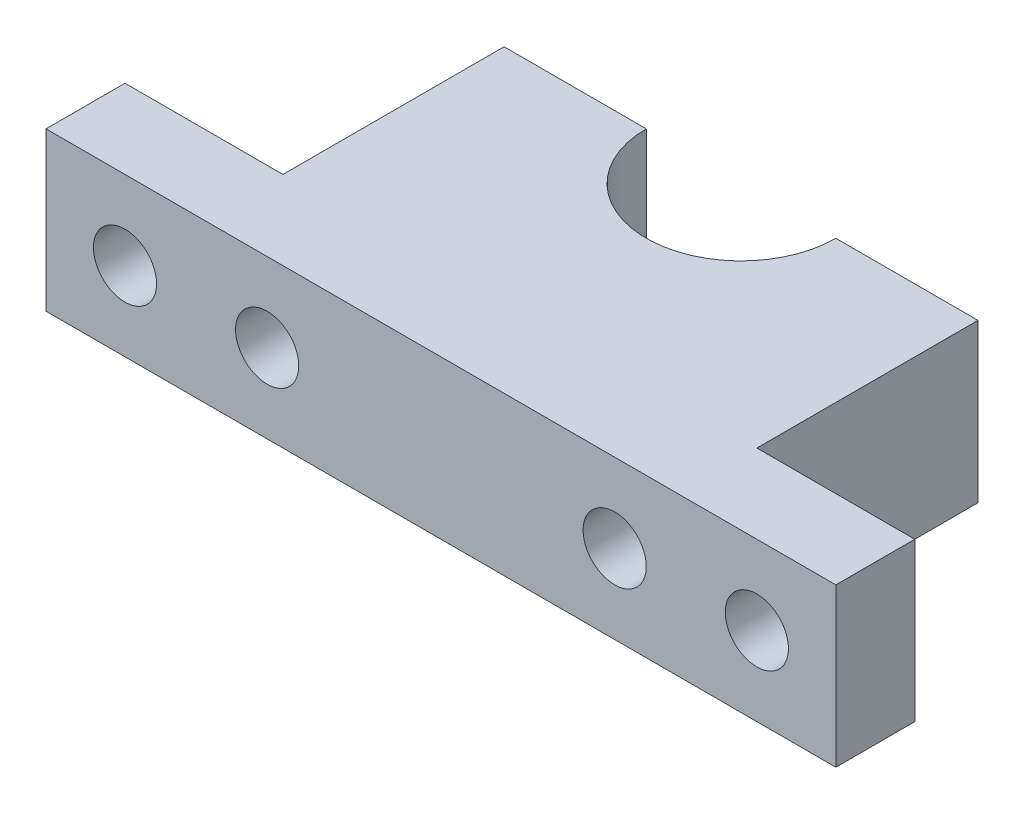
ISO-10303-21;
HEADER;
FILE_DESCRIPTION(('STEP AP214'),'2;1');
FILE_NAME('part.step','',(''),(''),'','','');
FILE_SCHEMA(('AUTOMOTIVE_DESIGN { 1 0 10303 214 1 1 1 1 }'));
ENDSEC;
DATA;
#1=APPLICATION_CONTEXT('core data for automotive mechanical design processes');
#2=APPLICATION_PROTOCOL_DEFINITION('international standard','automotive_design',2000,#1);
#3=PRODUCT_CONTEXT('',#1,'mechanical');
#4=PRODUCT('Part','Part','',(#3));
#5=PRODUCT_RELATED_PRODUCT_CATEGORY('part','',(#4));
#6=PRODUCT_DEFINITION_FORMATION('','',#4);
#7=PRODUCT_DEFINITION_CONTEXT('part definition',#1,'design');
#8=PRODUCT_DEFINITION('design','',#6,#7);
#9=PRODUCT_DEFINITION_SHAPE('','',#8);
#10=(LENGTH_UNIT() NAMED_UNIT(*) SI_UNIT(.MILLI.,.METRE.));
#11=(NAMED_UNIT(*) PLANE_ANGLE_UNIT() SI_UNIT($,.RADIAN.));
#12=(NAMED_UNIT(*) SI_UNIT($,.STERADIAN.) SOLID_ANGLE_UNIT());
#13=UNCERTAINTY_MEASURE_WITH_UNIT(LENGTH_MEASURE(1.E-05),#10,'distance_accuracy_value','');
#14=(GEOMETRIC_REPRESENTATION_CONTEXT(3) GLOBAL_UNCERTAINTY_ASSIGNED_CONTEXT((#13)) GLOBAL_UNIT_ASSIGNED_CONTEXT((#10,
#11,#12)) REPRESENTATION_CONTEXT('',''));
#15=CARTESIAN_POINT('',(0.,0.,0.));
#16=DIRECTION('',(0.,0.,1.));
#17=DIRECTION('',(1.,0.,0.));
#18=AXIS2_PLACEMENT_3D('',#15,#16,#17);
#19=CARTESIAN_POINT('',(-25.,10.,0.));
#20=DIRECTION('',(1.,0.,0.));
#21=DIRECTION('',(0.,0.,-1.));
#22=AXIS2_PLACEMENT_3D('',#19,#20,#21);
#23=PLANE('',#22);
#24=DIRECTION('',(0.,0.,1.));
#25=VECTOR('',#24,1.);
#26=CARTESIAN_POINT('',(-25.,0.,0.));
#27=LINE('',#26,#25);
#28=CARTESIAN_POINT('',(-25.,0.,-5.));
#29=VERTEX_POINT('',#28);
#30=CARTESIAN_POINT('',(-25.,0.,0.));
#31=VERTEX_POINT('',#30);
#32=EDGE_CURVE('E156',#29,#31,#27,.T.);
#33=ORIENTED_EDGE('',*,*,#32,.T.);
#34=DIRECTION('',(0.,-1.,0.));
#35=VECTOR('',#34,1.);
#36=CARTESIAN_POINT('',(-25.,10.,0.));
#37=LINE('',#36,#35);
#38=CARTESIAN_POINT('',(-25.,10.,0.));
#39=VERTEX_POINT('',#38);
#40=EDGE_CURVE('E11',#39,#31,#37,.T.);
#41=ORIENTED_EDGE('',*,*,#40,.F.);
#42=DIRECTION('',(0.,0.,1.));
#43=VECTOR('',#42,1.);
#44=CARTESIAN_POINT('',(-25.,10.,0.));
#45=LINE('',#44,#43);
#46=CARTESIAN_POINT('',(-25.,10.,-5.));
#47=VERTEX_POINT('',#46);
#48=EDGE_CURVE('E184',#47,#39,#45,.T.);
#49=ORIENTED_EDGE('',*,*,#48,.F.);
#50=DIRECTION('',(0.,-1.,0.));
#51=VECTOR('',#50,1.);
#52=CARTESIAN_POINT('',(-25.,10.,-5.));
#53=LINE('',#52,#51);
#54=EDGE_CURVE('E152',#47,#29,#53,.T.);
#55=ORIENTED_EDGE('',*,*,#54,.T.);
#56=EDGE_LOOP('',(#33,#41,#49,#55));
#57=FACE_BOUND('',#56,.T.);
#58=ADVANCED_FACE('F41',(#57),#23,.F.);
#59=CARTESIAN_POINT('',(25.,10.,0.));
#60=DIRECTION('',(0.,0.,-1.));
#61=DIRECTION('',(-1.,0.,0.));
#62=AXIS2_PLACEMENT_3D('',#59,#60,#61);
#63=PLANE('',#62);
#64=CARTESIAN_POINT('',(-20.,5.,0.));
#65=DIRECTION('',(0.,0.,1.));
#66=DIRECTION('',(1.,0.,0.));
#67=AXIS2_PLACEMENT_3D('',#64,#65,#66);
#68=CIRCLE('',#67,2.);
#69=CARTESIAN_POINT('',(-18.,5.,0.));
#70=VERTEX_POINT('',#69);
#71=EDGE_CURVE('E212',#70,#70,#68,.T.);
#72=ORIENTED_EDGE('',*,*,#71,.F.);
#73=EDGE_LOOP('',(#72));
#74=FACE_BOUND('',#73,.T.);
#75=CARTESIAN_POINT('',(11.,5.,0.));
#76=DIRECTION('',(0.,0.,1.));
#77=DIRECTION('',(-1.,0.,0.));
#78=AXIS2_PLACEMENT_3D('',#75,#76,#77);
#79=CIRCLE('',#78,2.);
#80=CARTESIAN_POINT('',(9.,5.,0.));
#81=VERTEX_POINT('',#80);
#82=EDGE_CURVE('E233',#81,#81,#79,.T.);
#83=ORIENTED_EDGE('',*,*,#82,.F.);
#84=EDGE_LOOP('',(#83));
#85=FACE_BOUND('',#84,.T.);
#86=CARTESIAN_POINT('',(20.,5.,0.));
#87=DIRECTION('',(0.,0.,1.));
#88=DIRECTION('',(-1.,0.,0.));
#89=AXIS2_PLACEMENT_3D('',#86,#87,#88);
#90=CIRCLE('',#89,2.);
#91=CARTESIAN_POINT('',(18.,5.,0.));
#92=VERTEX_POINT('',#91);
#93=EDGE_CURVE('E232',#92,#92,#90,.T.);
#94=ORIENTED_EDGE('',*,*,#93,.F.);
#95=EDGE_LOOP('',(#94));
#96=FACE_BOUND('',#95,.T.);
#97=CARTESIAN_POINT('',(-11.,5.,0.));
#98=DIRECTION('',(0.,0.,1.));
#99=DIRECTION('',(1.,0.,0.));
#100=AXIS2_PLACEMENT_3D('',#97,#98,#99);
#101=CIRCLE('',#100,2.);
#102=CARTESIAN_POINT('',(-9.,5.,0.));
#103=VERTEX_POINT('',#102);
#104=EDGE_CURVE('E225',#103,#103,#101,.T.);
#105=ORIENTED_EDGE('',*,*,#104,.F.);
#106=EDGE_LOOP('',(#105));
#107=FACE_BOUND('',#106,.T.);
#108=DIRECTION('',(1.,0.,0.));
#109=VECTOR('',#108,1.);
#110=CARTESIAN_POINT('',(25.,0.,0.));
#111=LINE('',#110,#109);
#112=CARTESIAN_POINT('',(25.,0.,0.));
#113=VERTEX_POINT('',#112);
#114=EDGE_CURVE('E160',#31,#113,#111,.T.);
#115=ORIENTED_EDGE('',*,*,#114,.T.);
#116=DIRECTION('',(0.,-1.,0.));
#117=VECTOR('',#116,1.);
#118=CARTESIAN_POINT('',(25.,10.,0.));
#119=LINE('',#118,#117);
#120=CARTESIAN_POINT('',(25.,10.,0.));
#121=VERTEX_POINT('',#120);
#122=EDGE_CURVE('E51',#121,#113,#119,.T.);
#123=ORIENTED_EDGE('',*,*,#122,.F.);
#124=DIRECTION('',(1.,0.,0.));
#125=VECTOR('',#124,1.);
#126=CARTESIAN_POINT('',(25.,10.,0.));
#127=LINE('',#126,#125);
#128=EDGE_CURVE('E109',#39,#121,#127,.T.);
#129=ORIENTED_EDGE('',*,*,#128,.F.);
#130=ORIENTED_EDGE('',*,*,#40,.T.);
#131=EDGE_LOOP('',(#115,#123,#129,#130));
#132=FACE_BOUND('',#131,.T.);
#133=ADVANCED_FACE('F287',(#74,#85,#96,#107,#132),#63,.F.);
#134=CARTESIAN_POINT('',(25.,10.,0.));
#135=DIRECTION('',(-1.,0.,0.));
#136=DIRECTION('',(0.,0.,1.));
#137=AXIS2_PLACEMENT_3D('',#134,#135,#136);
#138=PLANE('',#137);
#139=DIRECTION('',(0.,0.,-1.));
#140=VECTOR('',#139,1.);
#141=CARTESIAN_POINT('',(25.,0.,0.));
#142=LINE('',#141,#140);
#143=CARTESIAN_POINT('',(25.,0.,-5.));
#144=VERTEX_POINT('',#143);
#145=EDGE_CURVE('E163',#113,#144,#142,.T.);
#146=ORIENTED_EDGE('',*,*,#145,.T.);
#147=DIRECTION('',(0.,-1.,0.));
#148=VECTOR('',#147,1.);
#149=CARTESIAN_POINT('',(25.,10.,-5.));
#150=LINE('',#149,#148);
#151=CARTESIAN_POINT('',(25.,10.,-5.));
#152=VERTEX_POINT('',#151);
#153=EDGE_CURVE('E203',#152,#144,#150,.T.);
#154=ORIENTED_EDGE('',*,*,#153,.F.);
#155=DIRECTION('',(0.,0.,-1.));
#156=VECTOR('',#155,1.);
#157=CARTESIAN_POINT('',(25.,10.,0.));
#158=LINE('',#157,#156);
#159=EDGE_CURVE('E247',#121,#152,#158,.T.);
#160=ORIENTED_EDGE('',*,*,#159,.F.);
#161=ORIENTED_EDGE('',*,*,#122,.T.);
#162=EDGE_LOOP('',(#146,#154,#160,#161));
#163=FACE_BOUND('',#162,.T.);
#164=ADVANCED_FACE('F291',(#163),#138,.F.);
#165=CARTESIAN_POINT('',(25.,10.,-5.));
#166=DIRECTION('',(0.,0.,1.));
#167=DIRECTION('',(1.,0.,0.));
#168=AXIS2_PLACEMENT_3D('',#165,#166,#167);
#169=PLANE('',#168);
#170=CARTESIAN_POINT('',(20.,5.,-5.));
#171=DIRECTION('',(0.,0.,1.));
#172=DIRECTION('',(1.,0.,0.));
#173=AXIS2_PLACEMENT_3D('',#170,#171,#172);
#174=CIRCLE('',#173,2.);
#175=CARTESIAN_POINT('',(22.,5.,-5.));
#176=VERTEX_POINT('',#175);
#177=EDGE_CURVE('E44',#176,#176,#174,.T.);
#178=ORIENTED_EDGE('',*,*,#177,.T.);
#179=EDGE_LOOP('',(#178));
#180=FACE_BOUND('',#179,.T.);
#181=DIRECTION('',(-1.,0.,0.));
#182=VECTOR('',#181,1.);
#183=CARTESIAN_POINT('',(25.,0.,-5.));
#184=LINE('',#183,#182);
#185=CARTESIAN_POINT('',(15.,0.,-5.));
#186=VERTEX_POINT('',#185);
#187=EDGE_CURVE('E166',#144,#186,#184,.T.);
#188=ORIENTED_EDGE('',*,*,#187,.T.);
#189=DIRECTION('',(0.,-1.,0.));
#190=VECTOR('',#189,1.);
#191=CARTESIAN_POINT('',(15.,10.,-5.));
#192=LINE('',#191,#190);
#193=CARTESIAN_POINT('',(15.,10.,-5.));
#194=VERTEX_POINT('',#193);
#195=EDGE_CURVE('E199',#194,#186,#192,.T.);
#196=ORIENTED_EDGE('',*,*,#195,.F.);
#197=DIRECTION('',(-1.,0.,0.));
#198=VECTOR('',#197,1.);
#199=CARTESIAN_POINT('',(25.,10.,-5.));
#200=LINE('',#199,#198);
#201=EDGE_CURVE('E250',#152,#194,#200,.T.);
#202=ORIENTED_EDGE('',*,*,#201,.F.);
#203=ORIENTED_EDGE('',*,*,#153,.T.);
#204=EDGE_LOOP('',(#188,#196,#202,#203));
#205=FACE_BOUND('',#204,.T.);
#206=ADVANCED_FACE('F296',(#180,#205),#169,.F.);
#207=CARTESIAN_POINT('',(15.,10.,-5.));
#208=DIRECTION('',(-1.,0.,0.));
#209=DIRECTION('',(0.,0.,1.));
#210=AXIS2_PLACEMENT_3D('',#207,#208,#209);
#211=PLANE('',#210);
#212=DIRECTION('',(0.,0.,-1.));
#213=VECTOR('',#212,1.);
#214=CARTESIAN_POINT('',(15.,0.,-5.));
#215=LINE('',#214,#213);
#216=CARTESIAN_POINT('',(15.,0.,-19.));
#217=VERTEX_POINT('',#216);
#218=EDGE_CURVE('E169',#186,#217,#215,.T.);
#219=ORIENTED_EDGE('',*,*,#218,.T.);
#220=DIRECTION('',(0.,-1.,0.));
#221=VECTOR('',#220,1.);
#222=CARTESIAN_POINT('',(15.,10.,-19.));
#223=LINE('',#222,#221);
#224=CARTESIAN_POINT('',(15.,10.,-19.));
#225=VERTEX_POINT('',#224);
#226=EDGE_CURVE('E195',#225,#217,#223,.T.);
#227=ORIENTED_EDGE('',*,*,#226,.F.);
#228=DIRECTION('',(0.,0.,-1.));
#229=VECTOR('',#228,1.);
#230=CARTESIAN_POINT('',(15.,10.,-5.));
#231=LINE('',#230,#229);
#232=EDGE_CURVE('E253',#194,#225,#231,.T.);
#233=ORIENTED_EDGE('',*,*,#232,.F.);
#234=ORIENTED_EDGE('',*,*,#195,.T.);
#235=EDGE_LOOP('',(#219,#227,#233,#234));
#236=FACE_BOUND('',#235,.T.);
#237=ADVANCED_FACE('F303',(#236),#211,.F.);
#238=CARTESIAN_POINT('',(6.,10.,-19.));
#239=DIRECTION('',(0.,0.,1.));
#240=DIRECTION('',(1.,0.,0.));
#241=AXIS2_PLACEMENT_3D('',#238,#239,#240);
#242=PLANE('',#241);
#243=CARTESIAN_POINT('',(11.,5.,-19.));
#244=DIRECTION('',(0.,0.,1.));
#245=DIRECTION('',(-1.,0.,0.));
#246=AXIS2_PLACEMENT_3D('',#243,#244,#245);
#247=CIRCLE('',#246,2.);
#248=CARTESIAN_POINT('',(9.,5.,-19.));
#249=VERTEX_POINT('',#248);
#250=EDGE_CURVE('E228',#249,#249,#247,.T.);
#251=ORIENTED_EDGE('',*,*,#250,.T.);
#252=EDGE_LOOP('',(#251));
#253=FACE_BOUND('',#252,.T.);
#254=DIRECTION('',(-1.,0.,0.));
#255=VECTOR('',#254,1.);
#256=CARTESIAN_POINT('',(6.,0.,-19.));
#257=LINE('',#256,#255);
#258=CARTESIAN_POINT('',(6.,0.,-19.));
#259=VERTEX_POINT('',#258);
#260=EDGE_CURVE('E172',#217,#259,#257,.T.);
#261=ORIENTED_EDGE('',*,*,#260,.T.);
#262=DIRECTION('',(0.,-1.,0.));
#263=VECTOR('',#262,1.);
#264=CARTESIAN_POINT('',(6.,10.,-19.));
#265=LINE('',#264,#263);
#266=CARTESIAN_POINT('',(6.,10.,-19.));
#267=VERTEX_POINT('',#266);
#268=EDGE_CURVE('E191',#267,#259,#265,.T.);
#269=ORIENTED_EDGE('',*,*,#268,.F.);
#270=DIRECTION('',(-1.,0.,0.));
#271=VECTOR('',#270,1.);
#272=CARTESIAN_POINT('',(6.,10.,-19.));
#273=LINE('',#272,#271);
#274=EDGE_CURVE('E256',#225,#267,#273,.T.);
#275=ORIENTED_EDGE('',*,*,#274,.F.);
#276=ORIENTED_EDGE('',*,*,#226,.T.);
#277=EDGE_LOOP('',(#261,#269,#275,#276));
#278=FACE_BOUND('',#277,.T.);
#279=ADVANCED_FACE('F264',(#253,#278),#242,.F.);
#280=CARTESIAN_POINT('',(0.,10.,-19.));
#281=DIRECTION('',(0.,-1.,0.));
#282=DIRECTION('',(0.,0.,-1.));
#283=AXIS2_PLACEMENT_3D('',#280,#281,#282);
#284=CYLINDRICAL_SURFACE('',#283,6.);
#285=CARTESIAN_POINT('',(0.,0.,-19.));
#286=DIRECTION('',(0.,-1.,0.));
#287=DIRECTION('',(0.,0.,1.));
#288=AXIS2_PLACEMENT_3D('',#285,#286,#287);
#289=CIRCLE('',#288,6.);
#290=CARTESIAN_POINT('',(-6.,0.,-19.));
#291=VERTEX_POINT('',#290);
#292=EDGE_CURVE('E175',#259,#291,#289,.T.);
#293=ORIENTED_EDGE('',*,*,#292,.T.);
#294=DIRECTION('',(0.,-1.,0.));
#295=VECTOR('',#294,1.);
#296=CARTESIAN_POINT('',(-6.,10.,-19.));
#297=LINE('',#296,#295);
#298=CARTESIAN_POINT('',(-6.,10.,-19.));
#299=VERTEX_POINT('',#298);
#300=EDGE_CURVE('E145',#299,#291,#297,.T.);
#301=ORIENTED_EDGE('',*,*,#300,.F.);
#302=CARTESIAN_POINT('',(0.,10.,-19.));
#303=DIRECTION('',(0.,-1.,0.));
#304=DIRECTION('',(0.,0.,1.));
#305=AXIS2_PLACEMENT_3D('',#302,#303,#304);
#306=CIRCLE('',#305,6.);
#307=EDGE_CURVE('E134',#267,#299,#306,.T.);
#308=ORIENTED_EDGE('',*,*,#307,.F.);
#309=ORIENTED_EDGE('',*,*,#268,.T.);
#310=EDGE_LOOP('',(#293,#301,#308,#309));
#311=FACE_BOUND('',#310,.T.);
#312=ADVANCED_FACE('F268',(#311),#284,.F.);
#313=CARTESIAN_POINT('',(-15.,10.,-19.));
#314=DIRECTION('',(0.,0.,1.));
#315=DIRECTION('',(1.,0.,0.));
#316=AXIS2_PLACEMENT_3D('',#313,#314,#315);
#317=PLANE('',#316);
#318=CARTESIAN_POINT('',(-11.,5.,-19.));
#319=DIRECTION('',(0.,0.,1.));
#320=DIRECTION('',(1.,0.,0.));
#321=AXIS2_PLACEMENT_3D('',#318,#319,#320);
#322=CIRCLE('',#321,2.);
#323=CARTESIAN_POINT('',(-9.,5.,-19.));
#324=VERTEX_POINT('',#323);
#325=EDGE_CURVE('E219',#324,#324,#322,.T.);
#326=ORIENTED_EDGE('',*,*,#325,.T.);
#327=EDGE_LOOP('',(#326));
#328=FACE_BOUND('',#327,.T.);
#329=DIRECTION('',(-1.,0.,0.));
#330=VECTOR('',#329,1.);
#331=CARTESIAN_POINT('',(-15.,0.,-19.));
#332=LINE('',#331,#330);
#333=CARTESIAN_POINT('',(-15.,0.,-19.));
#334=VERTEX_POINT('',#333);
#335=EDGE_CURVE('E143',#291,#334,#332,.T.);
#336=ORIENTED_EDGE('',*,*,#335,.T.);
#337=DIRECTION('',(0.,-1.,0.));
#338=VECTOR('',#337,1.);
#339=CARTESIAN_POINT('',(-15.,10.,-19.));
#340=LINE('',#339,#338);
#341=CARTESIAN_POINT('',(-15.,10.,-19.));
#342=VERTEX_POINT('',#341);
#343=EDGE_CURVE('E140',#342,#334,#340,.T.);
#344=ORIENTED_EDGE('',*,*,#343,.F.);
#345=DIRECTION('',(-1.,0.,0.));
#346=VECTOR('',#345,1.);
#347=CARTESIAN_POINT('',(-15.,10.,-19.));
#348=LINE('',#347,#346);
#349=EDGE_CURVE('E128',#299,#342,#348,.T.);
#350=ORIENTED_EDGE('',*,*,#349,.F.);
#351=ORIENTED_EDGE('',*,*,#300,.T.);
#352=EDGE_LOOP('',(#336,#344,#350,#351));
#353=FACE_BOUND('',#352,.T.);
#354=ADVANCED_FACE('F141',(#328,#353),#317,.F.);
#355=CARTESIAN_POINT('',(-15.,10.,-5.));
#356=DIRECTION('',(1.,0.,0.));
#357=DIRECTION('',(0.,0.,-1.));
#358=AXIS2_PLACEMENT_3D('',#355,#356,#357);
#359=PLANE('',#358);
#360=DIRECTION('',(0.,0.,1.));
#361=VECTOR('',#360,1.);
#362=CARTESIAN_POINT('',(-15.,0.,-5.));
#363=LINE('',#362,#361);
#364=CARTESIAN_POINT('',(-15.,0.,-5.));
#365=VERTEX_POINT('',#364);
#366=EDGE_CURVE('E95',#334,#365,#363,.T.);
#367=ORIENTED_EDGE('',*,*,#366,.T.);
#368=DIRECTION('',(0.,-1.,0.));
#369=VECTOR('',#368,1.);
#370=CARTESIAN_POINT('',(-15.,10.,-5.));
#371=LINE('',#370,#369);
#372=CARTESIAN_POINT('',(-15.,10.,-5.));
#373=VERTEX_POINT('',#372);
#374=EDGE_CURVE('E146',#373,#365,#371,.T.);
#375=ORIENTED_EDGE('',*,*,#374,.F.);
#376=DIRECTION('',(0.,0.,1.));
#377=VECTOR('',#376,1.);
#378=CARTESIAN_POINT('',(-15.,10.,-5.));
#379=LINE('',#378,#377);
#380=EDGE_CURVE('E132',#342,#373,#379,.T.);
#381=ORIENTED_EDGE('',*,*,#380,.F.);
#382=ORIENTED_EDGE('',*,*,#343,.T.);
#383=EDGE_LOOP('',(#367,#375,#381,#382));
#384=FACE_BOUND('',#383,.T.);
#385=ADVANCED_FACE('F148',(#384),#359,.F.);
#386=CARTESIAN_POINT('',(-25.,10.,-5.));
#387=DIRECTION('',(0.,0.,1.));
#388=DIRECTION('',(1.,0.,0.));
#389=AXIS2_PLACEMENT_3D('',#386,#387,#388);
#390=PLANE('',#389);
#391=CARTESIAN_POINT('',(-20.,5.,-5.));
#392=DIRECTION('',(0.,0.,1.));
#393=DIRECTION('',(1.,0.,0.));
#394=AXIS2_PLACEMENT_3D('',#391,#392,#393);
#395=CIRCLE('',#394,2.);
#396=CARTESIAN_POINT('',(-18.,5.,-5.));
#397=VERTEX_POINT('',#396);
#398=EDGE_CURVE('E209',#397,#397,#395,.T.);
#399=ORIENTED_EDGE('',*,*,#398,.T.);
#400=EDGE_LOOP('',(#399));
#401=FACE_BOUND('',#400,.T.);
#402=DIRECTION('',(-1.,0.,0.));
#403=VECTOR('',#402,1.);
#404=CARTESIAN_POINT('',(-25.,0.,-5.));
#405=LINE('',#404,#403);
#406=EDGE_CURVE('E101',#365,#29,#405,.T.);
#407=ORIENTED_EDGE('',*,*,#406,.T.);
#408=ORIENTED_EDGE('',*,*,#54,.F.);
#409=DIRECTION('',(-1.,0.,0.));
#410=VECTOR('',#409,1.);
#411=CARTESIAN_POINT('',(-25.,10.,-5.));
#412=LINE('',#411,#410);
#413=EDGE_CURVE('E60',#373,#47,#412,.T.);
#414=ORIENTED_EDGE('',*,*,#413,.F.);
#415=ORIENTED_EDGE('',*,*,#374,.T.);
#416=EDGE_LOOP('',(#407,#408,#414,#415));
#417=FACE_BOUND('',#416,.T.);
#418=ADVANCED_FACE('F276',(#401,#417),#390,.F.);
#419=CARTESIAN_POINT('',(0.,10.,-19.));
#420=DIRECTION('',(0.,1.,0.));
#421=DIRECTION('',(0.,0.,1.));
#422=AXIS2_PLACEMENT_3D('',#419,#420,#421);
#423=PLANE('',#422);
#424=ORIENTED_EDGE('',*,*,#48,.T.);
#425=ORIENTED_EDGE('',*,*,#128,.T.);
#426=ORIENTED_EDGE('',*,*,#159,.T.);
#427=ORIENTED_EDGE('',*,*,#201,.T.);
#428=ORIENTED_EDGE('',*,*,#232,.T.);
#429=ORIENTED_EDGE('',*,*,#274,.T.);
#430=ORIENTED_EDGE('',*,*,#307,.T.);
#431=ORIENTED_EDGE('',*,*,#349,.T.);
#432=ORIENTED_EDGE('',*,*,#380,.T.);
#433=ORIENTED_EDGE('',*,*,#413,.T.);
#434=EDGE_LOOP('',(#424,#425,#426,#427,#428,#429,#430,#431,#432,#433));
#435=FACE_BOUND('',#434,.T.);
#436=ADVANCED_FACE('F130',(#435),#423,.T.);
#437=CARTESIAN_POINT('',(0.,0.,-19.));
#438=DIRECTION('',(0.,1.,0.));
#439=DIRECTION('',(0.,0.,1.));
#440=AXIS2_PLACEMENT_3D('',#437,#438,#439);
#441=PLANE('',#440);
#442=ORIENTED_EDGE('',*,*,#32,.F.);
#443=ORIENTED_EDGE('',*,*,#406,.F.);
#444=ORIENTED_EDGE('',*,*,#366,.F.);
#445=ORIENTED_EDGE('',*,*,#335,.F.);
#446=ORIENTED_EDGE('',*,*,#292,.F.);
#447=ORIENTED_EDGE('',*,*,#260,.F.);
#448=ORIENTED_EDGE('',*,*,#218,.F.);
#449=ORIENTED_EDGE('',*,*,#187,.F.);
#450=ORIENTED_EDGE('',*,*,#145,.F.);
#451=ORIENTED_EDGE('',*,*,#114,.F.);
#452=EDGE_LOOP('',(#442,#443,#444,#445,#446,#447,#448,#449,#450,#451));
#453=FACE_BOUND('',#452,.T.);
#454=ADVANCED_FACE('F271',(#453),#441,.F.);
#455=CARTESIAN_POINT('',(-20.,5.,-19.));
#456=DIRECTION('',(0.,0.,1.));
#457=DIRECTION('',(1.,0.,0.));
#458=AXIS2_PLACEMENT_3D('',#455,#456,#457);
#459=CYLINDRICAL_SURFACE('',#458,2.);
#460=ORIENTED_EDGE('',*,*,#71,.T.);
#461=EDGE_LOOP('',(#460));
#462=FACE_BOUND('',#461,.T.);
#463=ORIENTED_EDGE('',*,*,#398,.F.);
#464=EDGE_LOOP('',(#463));
#465=FACE_BOUND('',#464,.T.);
#466=ADVANCED_FACE('F323',(#462,#465),#459,.F.);
#467=CARTESIAN_POINT('',(-11.,5.,-19.));
#468=DIRECTION('',(0.,0.,1.));
#469=DIRECTION('',(1.,0.,0.));
#470=AXIS2_PLACEMENT_3D('',#467,#468,#469);
#471=CYLINDRICAL_SURFACE('',#470,2.);
#472=ORIENTED_EDGE('',*,*,#325,.F.);
#473=EDGE_LOOP('',(#472));
#474=FACE_BOUND('',#473,.T.);
#475=ORIENTED_EDGE('',*,*,#104,.T.);
#476=EDGE_LOOP('',(#475));
#477=FACE_BOUND('',#476,.T.);
#478=ADVANCED_FACE('F319',(#474,#477),#471,.F.);
#479=CARTESIAN_POINT('',(11.,5.,-19.));
#480=DIRECTION('',(0.,0.,1.));
#481=DIRECTION('',(1.,0.,0.));
#482=AXIS2_PLACEMENT_3D('',#479,#480,#481);
#483=CYLINDRICAL_SURFACE('',#482,2.);
#484=ORIENTED_EDGE('',*,*,#250,.F.);
#485=EDGE_LOOP('',(#484));
#486=FACE_BOUND('',#485,.T.);
#487=ORIENTED_EDGE('',*,*,#82,.T.);
#488=EDGE_LOOP('',(#487));
#489=FACE_BOUND('',#488,.T.);
#490=ADVANCED_FACE('F322',(#486,#489),#483,.F.);
#491=CARTESIAN_POINT('',(20.,5.,-19.));
#492=DIRECTION('',(0.,0.,1.));
#493=DIRECTION('',(1.,0.,0.));
#494=AXIS2_PLACEMENT_3D('',#491,#492,#493);
#495=CYLINDRICAL_SURFACE('',#494,2.);
#496=ORIENTED_EDGE('',*,*,#93,.T.);
#497=EDGE_LOOP('',(#496));
#498=FACE_BOUND('',#497,.T.);
#499=ORIENTED_EDGE('',*,*,#177,.F.);
#500=EDGE_LOOP('',(#499));
#501=FACE_BOUND('',#500,.T.);
#502=ADVANCED_FACE('F338',(#498,#501),#495,.F.);
#503=CLOSED_SHELL('',(#58,#133,#164,#206,#237,#279,#312,#354,#385,#418,#436,#454,#466,#478,#490,#502));
#504=MANIFOLD_SOLID_BREP('B2',#503);
#505=ADVANCED_BREP_SHAPE_REPRESENTATION('',(#18,#504),#14);
#506=SHAPE_DEFINITION_REPRESENTATION(#9,#505);
ENDSEC;
END-ISO-10303-21;
